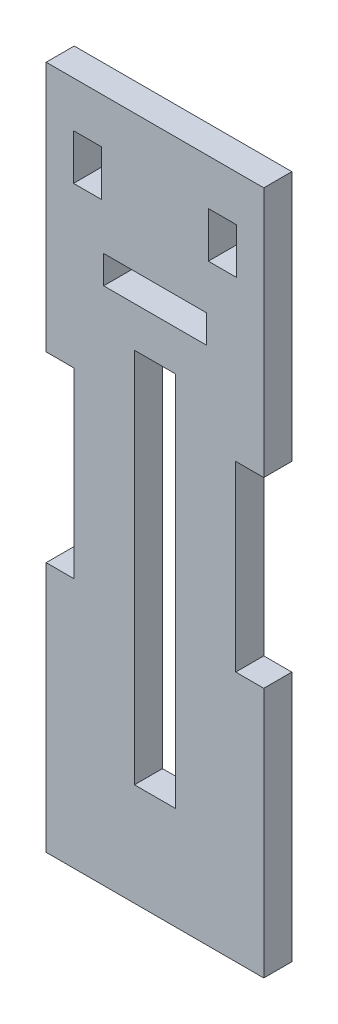
ISO-10303-21;
HEADER;
FILE_DESCRIPTION(('STEP AP214'),'2;1');
FILE_NAME('part.step','',(''),(''),'','','');
FILE_SCHEMA(('AUTOMOTIVE_DESIGN { 1 0 10303 214 1 1 1 1 }'));
ENDSEC;
DATA;
#1=APPLICATION_CONTEXT('core data for automotive mechanical design processes');
#2=APPLICATION_PROTOCOL_DEFINITION('international standard','automotive_design',2000,#1);
#3=PRODUCT_CONTEXT('',#1,'mechanical');
#4=PRODUCT('Part','Part','',(#3));
#5=PRODUCT_RELATED_PRODUCT_CATEGORY('part','',(#4));
#6=PRODUCT_DEFINITION_FORMATION('','',#4);
#7=PRODUCT_DEFINITION_CONTEXT('part definition',#1,'design');
#8=PRODUCT_DEFINITION('design','',#6,#7);
#9=PRODUCT_DEFINITION_SHAPE('','',#8);
#10=(LENGTH_UNIT() NAMED_UNIT(*) SI_UNIT(.MILLI.,.METRE.));
#11=(NAMED_UNIT(*) PLANE_ANGLE_UNIT() SI_UNIT($,.RADIAN.));
#12=(NAMED_UNIT(*) SI_UNIT($,.STERADIAN.) SOLID_ANGLE_UNIT());
#13=UNCERTAINTY_MEASURE_WITH_UNIT(LENGTH_MEASURE(1.E-05),#10,'distance_accuracy_value','');
#14=(GEOMETRIC_REPRESENTATION_CONTEXT(3) GLOBAL_UNCERTAINTY_ASSIGNED_CONTEXT((#13)) GLOBAL_UNIT_ASSIGNED_CONTEXT((#10,
#11,#12)) REPRESENTATION_CONTEXT('',''));
#15=CARTESIAN_POINT('',(0.,0.,0.));
#16=DIRECTION('',(0.,0.,1.));
#17=DIRECTION('',(1.,0.,0.));
#18=AXIS2_PLACEMENT_3D('',#15,#16,#17);
#19=CARTESIAN_POINT('',(0.,0.,0.));
#20=DIRECTION('',(0.,0.,1.));
#21=DIRECTION('',(1.,0.,0.));
#22=AXIS2_PLACEMENT_3D('',#19,#20,#21);
#23=PLANE('',#22);
#24=DIRECTION('',(0.,1.,0.));
#25=VECTOR('',#24,1.);
#26=CARTESIAN_POINT('',(-37.3616468699804,-19.3829047188593,0.));
#27=LINE('',#26,#25);
#28=CARTESIAN_POINT('',(-37.3616468699803,-89.2329047188593,0.));
#29=VERTEX_POINT('',#28);
#30=CARTESIAN_POINT('',(-37.3616468699804,-19.3829047188593,0.));
#31=VERTEX_POINT('',#30);
#32=EDGE_CURVE('E351',#29,#31,#27,.T.);
#33=ORIENTED_EDGE('',*,*,#32,.T.);
#34=DIRECTION('',(-1.,0.,0.));
#35=VECTOR('',#34,1.);
#36=CARTESIAN_POINT('',(-44.9816468699804,-19.3829047188593,0.));
#37=LINE('',#36,#35);
#38=CARTESIAN_POINT('',(-44.9816468699804,-19.3829047188593,0.));
#39=VERTEX_POINT('',#38);
#40=EDGE_CURVE('E365',#31,#39,#37,.T.);
#41=ORIENTED_EDGE('',*,*,#40,.T.);
#42=DIRECTION('',(0.,-1.,0.));
#43=VECTOR('',#42,1.);
#44=CARTESIAN_POINT('',(-44.9816468699804,-19.3829047188593,0.));
#45=LINE('',#44,#43);
#46=CARTESIAN_POINT('',(-44.9816468699803,-89.2329047188593,0.));
#47=VERTEX_POINT('',#46);
#48=EDGE_CURVE('E368',#39,#47,#45,.T.);
#49=ORIENTED_EDGE('',*,*,#48,.T.);
#50=DIRECTION('',(1.,0.,0.));
#51=VECTOR('',#50,1.);
#52=CARTESIAN_POINT('',(-44.9816468699803,-89.2329047188593,0.));
#53=LINE('',#52,#51);
#54=EDGE_CURVE('E355',#47,#29,#53,.T.);
#55=ORIENTED_EDGE('',*,*,#54,.T.);
#56=EDGE_LOOP('',(#33,#41,#49,#55));
#57=FACE_BOUND('',#56,.T.);
#58=DIRECTION('',(-1.,0.,0.));
#59=VECTOR('',#58,1.);
#60=CARTESIAN_POINT('',(-20.9786468699804,18.7170952811407,0.));
#61=LINE('',#60,#59);
#62=CARTESIAN_POINT('',(-20.9786468699804,18.7170952811407,0.));
#63=VERTEX_POINT('',#62);
#64=CARTESIAN_POINT('',(-61.3646468699804,18.7170952811407,0.));
#65=VERTEX_POINT('',#64);
#66=EDGE_CURVE('E398',#63,#65,#61,.T.);
#67=ORIENTED_EDGE('',*,*,#66,.F.);
#68=DIRECTION('',(0.,1.,0.));
#69=VECTOR('',#68,1.);
#70=CARTESIAN_POINT('',(-20.9786468699803,-108.282904718859,0.));
#71=LINE('',#70,#69);
#72=CARTESIAN_POINT('',(-20.9786468699803,-27.8495713855259,0.));
#73=VERTEX_POINT('',#72);
#74=EDGE_CURVE('E382',#73,#63,#71,.T.);
#75=ORIENTED_EDGE('',*,*,#74,.F.);
#76=DIRECTION('',(1.,0.,0.));
#77=VECTOR('',#76,1.);
#78=CARTESIAN_POINT('',(-26.1856468699803,-27.8495713855259,0.));
#79=LINE('',#78,#77);
#80=CARTESIAN_POINT('',(-26.1856468699803,-27.8495713855259,0.));
#81=VERTEX_POINT('',#80);
#82=EDGE_CURVE('E314',#81,#73,#79,.T.);
#83=ORIENTED_EDGE('',*,*,#82,.F.);
#84=DIRECTION('',(0.,1.,0.));
#85=VECTOR('',#84,1.);
#86=CARTESIAN_POINT('',(-26.1856468699803,0.,0.));
#87=LINE('',#86,#85);
#88=CARTESIAN_POINT('',(-26.1856468699803,-61.7162380521926,0.));
#89=VERTEX_POINT('',#88);
#90=EDGE_CURVE('E11',#89,#81,#87,.T.);
#91=ORIENTED_EDGE('',*,*,#90,.F.);
#92=DIRECTION('',(1.,0.,0.));
#93=VECTOR('',#92,1.);
#94=CARTESIAN_POINT('',(-26.1856468699803,-61.7162380521926,0.));
#95=LINE('',#94,#93);
#96=CARTESIAN_POINT('',(-20.9786468699803,-61.7162380521926,0.));
#97=VERTEX_POINT('',#96);
#98=EDGE_CURVE('E325',#89,#97,#95,.T.);
#99=ORIENTED_EDGE('',*,*,#98,.T.);
#100=CARTESIAN_POINT('',(-20.9786468699803,-108.282904718859,0.));
#101=VERTEX_POINT('',#100);
#102=EDGE_CURVE('E396',#101,#97,#71,.T.);
#103=ORIENTED_EDGE('',*,*,#102,.F.);
#104=DIRECTION('',(1.,0.,0.));
#105=VECTOR('',#104,1.);
#106=CARTESIAN_POINT('',(-20.9786468699803,-108.282904718859,0.));
#107=LINE('',#106,#105);
#108=CARTESIAN_POINT('',(-61.3646468699804,-108.282904718859,0.));
#109=VERTEX_POINT('',#108);
#110=EDGE_CURVE('E403',#109,#101,#107,.T.);
#111=ORIENTED_EDGE('',*,*,#110,.F.);
#112=DIRECTION('',(0.,-1.,0.));
#113=VECTOR('',#112,1.);
#114=CARTESIAN_POINT('',(-61.3646468699804,-108.282904718859,0.));
#115=LINE('',#114,#113);
#116=CARTESIAN_POINT('',(-61.3646468699804,-61.7162380521926,0.));
#117=VERTEX_POINT('',#116);
#118=EDGE_CURVE('E400',#117,#109,#115,.T.);
#119=ORIENTED_EDGE('',*,*,#118,.F.);
#120=DIRECTION('',(1.,0.,0.));
#121=VECTOR('',#120,1.);
#122=CARTESIAN_POINT('',(-61.3646468699804,-61.7162380521926,0.));
#123=LINE('',#122,#121);
#124=CARTESIAN_POINT('',(-56.1576468699804,-61.7162380521926,0.));
#125=VERTEX_POINT('',#124);
#126=EDGE_CURVE('E348',#117,#125,#123,.T.);
#127=ORIENTED_EDGE('',*,*,#126,.T.);
#128=DIRECTION('',(0.,1.,0.));
#129=VECTOR('',#128,1.);
#130=CARTESIAN_POINT('',(-56.1576468699803,0.,0.));
#131=LINE('',#130,#129);
#132=CARTESIAN_POINT('',(-56.1576468699804,-27.849571385526,0.));
#133=VERTEX_POINT('',#132);
#134=EDGE_CURVE('E41',#125,#133,#131,.T.);
#135=ORIENTED_EDGE('',*,*,#134,.T.);
#136=DIRECTION('',(1.,0.,0.));
#137=VECTOR('',#136,1.);
#138=CARTESIAN_POINT('',(-61.3646468699804,-27.849571385526,0.));
#139=LINE('',#138,#137);
#140=CARTESIAN_POINT('',(-61.3646468699804,-27.849571385526,0.));
#141=VERTEX_POINT('',#140);
#142=EDGE_CURVE('E335',#141,#133,#139,.T.);
#143=ORIENTED_EDGE('',*,*,#142,.F.);
#144=EDGE_CURVE('E401',#65,#141,#115,.T.);
#145=ORIENTED_EDGE('',*,*,#144,.F.);
#146=EDGE_LOOP('',(#67,#75,#83,#91,#99,#103,#111,#119,#127,#135,#143,#145));
#147=FACE_BOUND('',#146,.T.);
#148=DIRECTION('',(1.,0.,0.));
#149=VECTOR('',#148,1.);
#150=CARTESIAN_POINT('',(-31.2656468699804,10.2504286144741,0.));
#151=LINE('',#150,#149);
#152=CARTESIAN_POINT('',(-31.2656468699804,10.2504286144741,0.));
#153=VERTEX_POINT('',#152);
#154=CARTESIAN_POINT('',(-26.0586468699804,10.2504286144741,0.));
#155=VERTEX_POINT('',#154);
#156=EDGE_CURVE('E294',#153,#155,#151,.T.);
#157=ORIENTED_EDGE('',*,*,#156,.F.);
#158=DIRECTION('',(0.,-1.,0.));
#159=VECTOR('',#158,1.);
#160=CARTESIAN_POINT('',(-31.2656468699804,1.78376194780739,0.));
#161=LINE('',#160,#159);
#162=CARTESIAN_POINT('',(-31.2656468699804,1.78376194780739,0.));
#163=VERTEX_POINT('',#162);
#164=EDGE_CURVE('E276',#153,#163,#161,.T.);
#165=ORIENTED_EDGE('',*,*,#164,.T.);
#166=DIRECTION('',(1.,0.,0.));
#167=VECTOR('',#166,1.);
#168=CARTESIAN_POINT('',(-31.2656468699804,1.78376194780739,0.));
#169=LINE('',#168,#167);
#170=CARTESIAN_POINT('',(-26.0586468699804,1.78376194780739,0.));
#171=VERTEX_POINT('',#170);
#172=EDGE_CURVE('E291',#163,#171,#169,.T.);
#173=ORIENTED_EDGE('',*,*,#172,.T.);
#174=DIRECTION('',(0.,-1.,0.));
#175=VECTOR('',#174,1.);
#176=CARTESIAN_POINT('',(-26.0586468699804,1.78376194780739,0.));
#177=LINE('',#176,#175);
#178=EDGE_CURVE('E286',#155,#171,#177,.T.);
#179=ORIENTED_EDGE('',*,*,#178,.F.);
#180=EDGE_LOOP('',(#157,#165,#173,#179));
#181=FACE_BOUND('',#180,.T.);
#182=DIRECTION('',(-1.,0.,0.));
#183=VECTOR('',#182,1.);
#184=CARTESIAN_POINT('',(-51.0776468699804,1.78376194780742,0.));
#185=LINE('',#184,#183);
#186=CARTESIAN_POINT('',(-51.0776468699804,1.78376194780742,0.));
#187=VERTEX_POINT('',#186);
#188=CARTESIAN_POINT('',(-56.2846468699804,1.78376194780742,0.));
#189=VERTEX_POINT('',#188);
#190=EDGE_CURVE('E263',#187,#189,#185,.T.);
#191=ORIENTED_EDGE('',*,*,#190,.F.);
#192=DIRECTION('',(0.,1.,0.));
#193=VECTOR('',#192,1.);
#194=CARTESIAN_POINT('',(-51.0776468699804,10.2504286144741,0.));
#195=LINE('',#194,#193);
#196=CARTESIAN_POINT('',(-51.0776468699804,10.2504286144741,0.));
#197=VERTEX_POINT('',#196);
#198=EDGE_CURVE('E248',#187,#197,#195,.T.);
#199=ORIENTED_EDGE('',*,*,#198,.T.);
#200=DIRECTION('',(-1.,0.,0.));
#201=VECTOR('',#200,1.);
#202=CARTESIAN_POINT('',(-51.0776468699804,10.2504286144741,0.));
#203=LINE('',#202,#201);
#204=CARTESIAN_POINT('',(-56.2846468699804,10.2504286144741,0.));
#205=VERTEX_POINT('',#204);
#206=EDGE_CURVE('E260',#197,#205,#203,.T.);
#207=ORIENTED_EDGE('',*,*,#206,.T.);
#208=DIRECTION('',(0.,1.,0.));
#209=VECTOR('',#208,1.);
#210=CARTESIAN_POINT('',(-56.2846468699804,10.2504286144741,0.));
#211=LINE('',#210,#209);
#212=EDGE_CURVE('E242',#189,#205,#211,.T.);
#213=ORIENTED_EDGE('',*,*,#212,.F.);
#214=EDGE_LOOP('',(#191,#199,#207,#213));
#215=FACE_BOUND('',#214,.T.);
#216=DIRECTION('',(1.,0.,0.));
#217=VECTOR('',#216,1.);
#218=CARTESIAN_POINT('',(-50.6966468699804,-11.8899047188593,0.));
#219=LINE('',#218,#217);
#220=CARTESIAN_POINT('',(-50.6966468699804,-11.8899047188593,0.));
#221=VERTEX_POINT('',#220);
#222=CARTESIAN_POINT('',(-31.6466468699804,-11.8899047188593,0.));
#223=VERTEX_POINT('',#222);
#224=EDGE_CURVE('E225',#221,#223,#219,.T.);
#225=ORIENTED_EDGE('',*,*,#224,.T.);
#226=DIRECTION('',(0.,1.,0.));
#227=VECTOR('',#226,1.);
#228=CARTESIAN_POINT('',(-31.6466468699804,-11.8899047188593,0.));
#229=LINE('',#228,#227);
#230=CARTESIAN_POINT('',(-31.6466468699804,-6.68290471885927,0.));
#231=VERTEX_POINT('',#230);
#232=EDGE_CURVE('E740',#223,#231,#229,.T.);
#233=ORIENTED_EDGE('',*,*,#232,.T.);
#234=DIRECTION('',(1.,0.,0.));
#235=VECTOR('',#234,1.);
#236=CARTESIAN_POINT('',(-50.6966468699804,-6.68290471885927,0.));
#237=LINE('',#236,#235);
#238=CARTESIAN_POINT('',(-50.6966468699804,-6.68290471885927,0.));
#239=VERTEX_POINT('',#238);
#240=EDGE_CURVE('E746',#239,#231,#237,.T.);
#241=ORIENTED_EDGE('',*,*,#240,.F.);
#242=DIRECTION('',(0.,1.,0.));
#243=VECTOR('',#242,1.);
#244=CARTESIAN_POINT('',(-50.6966468699804,-11.8899047188593,0.));
#245=LINE('',#244,#243);
#246=EDGE_CURVE('E56',#221,#239,#245,.T.);
#247=ORIENTED_EDGE('',*,*,#246,.F.);
#248=EDGE_LOOP('',(#225,#233,#241,#247));
#249=FACE_BOUND('',#248,.T.);
#250=ADVANCED_FACE('F33',(#57,#147,#181,#215,#249),#23,.F.);
#251=CARTESIAN_POINT('',(0.,0.,5.207));
#252=DIRECTION('',(0.,0.,1.));
#253=DIRECTION('',(1.,0.,0.));
#254=AXIS2_PLACEMENT_3D('',#251,#252,#253);
#255=PLANE('',#254);
#256=DIRECTION('',(0.,1.,0.));
#257=VECTOR('',#256,1.);
#258=CARTESIAN_POINT('',(-31.6466468699804,-11.8899047188593,5.207));
#259=LINE('',#258,#257);
#260=CARTESIAN_POINT('',(-31.6466468699804,-11.8899047188593,5.207));
#261=VERTEX_POINT('',#260);
#262=CARTESIAN_POINT('',(-31.6466468699804,-6.68290471885927,5.207));
#263=VERTEX_POINT('',#262);
#264=EDGE_CURVE('E238',#261,#263,#259,.T.);
#265=ORIENTED_EDGE('',*,*,#264,.F.);
#266=DIRECTION('',(-1.,0.,0.));
#267=VECTOR('',#266,1.);
#268=CARTESIAN_POINT('',(0.,-11.8899047188593,5.207));
#269=LINE('',#268,#267);
#270=CARTESIAN_POINT('',(-50.6966468699804,-11.8899047188593,5.207));
#271=VERTEX_POINT('',#270);
#272=EDGE_CURVE('E222',#261,#271,#269,.T.);
#273=ORIENTED_EDGE('',*,*,#272,.T.);
#274=DIRECTION('',(0.,1.,0.));
#275=VECTOR('',#274,1.);
#276=CARTESIAN_POINT('',(-50.6966468699804,-11.8899047188593,5.207));
#277=LINE('',#276,#275);
#278=CARTESIAN_POINT('',(-50.6966468699804,-6.68290471885927,5.207));
#279=VERTEX_POINT('',#278);
#280=EDGE_CURVE('E228',#271,#279,#277,.T.);
#281=ORIENTED_EDGE('',*,*,#280,.T.);
#282=DIRECTION('',(-1.,0.,0.));
#283=VECTOR('',#282,1.);
#284=CARTESIAN_POINT('',(0.,-6.68290471885927,5.207));
#285=LINE('',#284,#283);
#286=EDGE_CURVE('E233',#263,#279,#285,.T.);
#287=ORIENTED_EDGE('',*,*,#286,.F.);
#288=EDGE_LOOP('',(#265,#273,#281,#287));
#289=FACE_BOUND('',#288,.T.);
#290=DIRECTION('',(-1.,0.,0.));
#291=VECTOR('',#290,1.);
#292=CARTESIAN_POINT('',(-44.9816468699804,-19.3829047188593,5.207));
#293=LINE('',#292,#291);
#294=CARTESIAN_POINT('',(-37.3616468699804,-19.3829047188593,5.207));
#295=VERTEX_POINT('',#294);
#296=CARTESIAN_POINT('',(-44.9816468699804,-19.3829047188593,5.207));
#297=VERTEX_POINT('',#296);
#298=EDGE_CURVE('E354',#295,#297,#293,.T.);
#299=ORIENTED_EDGE('',*,*,#298,.F.);
#300=DIRECTION('',(0.,1.,0.));
#301=VECTOR('',#300,1.);
#302=CARTESIAN_POINT('',(-37.3616468699804,-19.3829047188593,5.207));
#303=LINE('',#302,#301);
#304=CARTESIAN_POINT('',(-37.3616468699803,-89.2329047188593,5.207));
#305=VERTEX_POINT('',#304);
#306=EDGE_CURVE('E352',#305,#295,#303,.T.);
#307=ORIENTED_EDGE('',*,*,#306,.F.);
#308=DIRECTION('',(1.,0.,0.));
#309=VECTOR('',#308,1.);
#310=CARTESIAN_POINT('',(-44.9816468699803,-89.2329047188593,5.207));
#311=LINE('',#310,#309);
#312=CARTESIAN_POINT('',(-44.9816468699803,-89.2329047188593,5.207));
#313=VERTEX_POINT('',#312);
#314=EDGE_CURVE('E360',#313,#305,#311,.T.);
#315=ORIENTED_EDGE('',*,*,#314,.F.);
#316=DIRECTION('',(0.,-1.,0.));
#317=VECTOR('',#316,1.);
#318=CARTESIAN_POINT('',(-44.9816468699804,-19.3829047188593,5.207));
#319=LINE('',#318,#317);
#320=EDGE_CURVE('E357',#297,#313,#319,.T.);
#321=ORIENTED_EDGE('',*,*,#320,.F.);
#322=EDGE_LOOP('',(#299,#307,#315,#321));
#323=FACE_BOUND('',#322,.T.);
#324=DIRECTION('',(0.,-1.,0.));
#325=VECTOR('',#324,1.);
#326=CARTESIAN_POINT('',(-31.2656468699804,0.,5.207));
#327=LINE('',#326,#325);
#328=CARTESIAN_POINT('',(-31.2656468699804,10.2504286144741,5.207));
#329=VERTEX_POINT('',#328);
#330=CARTESIAN_POINT('',(-31.2656468699804,1.78376194780739,5.207));
#331=VERTEX_POINT('',#330);
#332=EDGE_CURVE('E302',#329,#331,#327,.T.);
#333=ORIENTED_EDGE('',*,*,#332,.F.);
#334=DIRECTION('',(1.,0.,0.));
#335=VECTOR('',#334,1.);
#336=CARTESIAN_POINT('',(-31.2656468699804,10.2504286144741,5.207));
#337=LINE('',#336,#335);
#338=CARTESIAN_POINT('',(-26.0586468699804,10.2504286144741,5.207));
#339=VERTEX_POINT('',#338);
#340=EDGE_CURVE('E296',#329,#339,#337,.T.);
#341=ORIENTED_EDGE('',*,*,#340,.T.);
#342=DIRECTION('',(0.,-1.,0.));
#343=VECTOR('',#342,1.);
#344=CARTESIAN_POINT('',(-26.0586468699804,0.,5.207));
#345=LINE('',#344,#343);
#346=CARTESIAN_POINT('',(-26.0586468699804,1.78376194780739,5.207));
#347=VERTEX_POINT('',#346);
#348=EDGE_CURVE('E299',#339,#347,#345,.T.);
#349=ORIENTED_EDGE('',*,*,#348,.T.);
#350=DIRECTION('',(1.,0.,0.));
#351=VECTOR('',#350,1.);
#352=CARTESIAN_POINT('',(-31.2656468699804,1.78376194780739,5.207));
#353=LINE('',#352,#351);
#354=EDGE_CURVE('E283',#331,#347,#353,.T.);
#355=ORIENTED_EDGE('',*,*,#354,.F.);
#356=EDGE_LOOP('',(#333,#341,#349,#355));
#357=FACE_BOUND('',#356,.T.);
#358=DIRECTION('',(-1.,0.,0.));
#359=VECTOR('',#358,1.);
#360=CARTESIAN_POINT('',(-20.9786468699804,18.7170952811407,5.207));
#361=LINE('',#360,#359);
#362=CARTESIAN_POINT('',(-20.9786468699804,18.7170952811407,5.207));
#363=VERTEX_POINT('',#362);
#364=CARTESIAN_POINT('',(-61.3646468699804,18.7170952811407,5.207));
#365=VERTEX_POINT('',#364);
#366=EDGE_CURVE('E386',#363,#365,#361,.T.);
#367=ORIENTED_EDGE('',*,*,#366,.T.);
#368=DIRECTION('',(0.,-1.,0.));
#369=VECTOR('',#368,1.);
#370=CARTESIAN_POINT('',(-61.3646468699804,-108.282904718859,5.207));
#371=LINE('',#370,#369);
#372=CARTESIAN_POINT('',(-61.3646468699804,-27.849571385526,5.207));
#373=VERTEX_POINT('',#372);
#374=EDGE_CURVE('E390',#365,#373,#371,.T.);
#375=ORIENTED_EDGE('',*,*,#374,.T.);
#376=DIRECTION('',(1.,0.,0.));
#377=VECTOR('',#376,1.);
#378=CARTESIAN_POINT('',(-61.3646468699804,-27.849571385526,5.20699999999997));
#379=LINE('',#378,#377);
#380=CARTESIAN_POINT('',(-56.1576468699804,-27.849571385526,5.20699999999997));
#381=VERTEX_POINT('',#380);
#382=EDGE_CURVE('E342',#373,#381,#379,.T.);
#383=ORIENTED_EDGE('',*,*,#382,.T.);
#384=DIRECTION('',(0.,1.,0.));
#385=VECTOR('',#384,1.);
#386=CARTESIAN_POINT('',(-56.1576468699804,-61.7162380521926,5.20699999999997));
#387=LINE('',#386,#385);
#388=CARTESIAN_POINT('',(-56.1576468699804,-61.7162380521926,5.20699999999997));
#389=VERTEX_POINT('',#388);
#390=EDGE_CURVE('E337',#389,#381,#387,.T.);
#391=ORIENTED_EDGE('',*,*,#390,.F.);
#392=DIRECTION('',(1.,0.,0.));
#393=VECTOR('',#392,1.);
#394=CARTESIAN_POINT('',(-61.3646468699804,-61.7162380521926,5.20699999999997));
#395=LINE('',#394,#393);
#396=CARTESIAN_POINT('',(-61.3646468699804,-61.7162380521926,5.20699999999997));
#397=VERTEX_POINT('',#396);
#398=EDGE_CURVE('E345',#397,#389,#395,.T.);
#399=ORIENTED_EDGE('',*,*,#398,.F.);
#400=CARTESIAN_POINT('',(-61.3646468699804,-108.282904718859,5.207));
#401=VERTEX_POINT('',#400);
#402=EDGE_CURVE('E389',#397,#401,#371,.T.);
#403=ORIENTED_EDGE('',*,*,#402,.T.);
#404=DIRECTION('',(1.,0.,0.));
#405=VECTOR('',#404,1.);
#406=CARTESIAN_POINT('',(-20.9786468699803,-108.282904718859,5.207));
#407=LINE('',#406,#405);
#408=CARTESIAN_POINT('',(-20.9786468699803,-108.282904718859,5.207));
#409=VERTEX_POINT('',#408);
#410=EDGE_CURVE('E393',#401,#409,#407,.T.);
#411=ORIENTED_EDGE('',*,*,#410,.T.);
#412=DIRECTION('',(0.,1.,0.));
#413=VECTOR('',#412,1.);
#414=CARTESIAN_POINT('',(-20.9786468699803,-108.282904718859,5.207));
#415=LINE('',#414,#413);
#416=CARTESIAN_POINT('',(-20.9786468699803,-61.7162380521926,5.20699999999997));
#417=VERTEX_POINT('',#416);
#418=EDGE_CURVE('E383',#409,#417,#415,.T.);
#419=ORIENTED_EDGE('',*,*,#418,.T.);
#420=DIRECTION('',(1.,0.,0.));
#421=VECTOR('',#420,1.);
#422=CARTESIAN_POINT('',(-26.1856468699803,-61.7162380521926,5.20699999999997));
#423=LINE('',#422,#421);
#424=CARTESIAN_POINT('',(-26.1856468699803,-61.7162380521926,5.20699999999997));
#425=VERTEX_POINT('',#424);
#426=EDGE_CURVE('E323',#425,#417,#423,.T.);
#427=ORIENTED_EDGE('',*,*,#426,.F.);
#428=DIRECTION('',(0.,1.,0.));
#429=VECTOR('',#428,1.);
#430=CARTESIAN_POINT('',(-26.1856468699803,-61.7162380521926,5.20699999999997));
#431=LINE('',#430,#429);
#432=CARTESIAN_POINT('',(-26.1856468699803,-27.8495713855259,5.20699999999996));
#433=VERTEX_POINT('',#432);
#434=EDGE_CURVE('E307',#425,#433,#431,.T.);
#435=ORIENTED_EDGE('',*,*,#434,.T.);
#436=DIRECTION('',(1.,0.,0.));
#437=VECTOR('',#436,1.);
#438=CARTESIAN_POINT('',(-26.1856468699803,-27.8495713855259,5.20699999999996));
#439=LINE('',#438,#437);
#440=CARTESIAN_POINT('',(-20.9786468699803,-27.8495713855259,5.20699999999996));
#441=VERTEX_POINT('',#440);
#442=EDGE_CURVE('E320',#433,#441,#439,.T.);
#443=ORIENTED_EDGE('',*,*,#442,.T.);
#444=EDGE_CURVE('E387',#441,#363,#415,.T.);
#445=ORIENTED_EDGE('',*,*,#444,.T.);
#446=EDGE_LOOP('',(#367,#375,#383,#391,#399,#403,#411,#419,#427,#435,#443,#445));
#447=FACE_BOUND('',#446,.T.);
#448=DIRECTION('',(0.,1.,0.));
#449=VECTOR('',#448,1.);
#450=CARTESIAN_POINT('',(-51.0776468699804,0.,5.207));
#451=LINE('',#450,#449);
#452=CARTESIAN_POINT('',(-51.0776468699804,1.78376194780742,5.20699999999998));
#453=VERTEX_POINT('',#452);
#454=CARTESIAN_POINT('',(-51.0776468699804,10.2504286144741,5.20699999999998));
#455=VERTEX_POINT('',#454);
#456=EDGE_CURVE('E271',#453,#455,#451,.T.);
#457=ORIENTED_EDGE('',*,*,#456,.F.);
#458=DIRECTION('',(-1.,0.,0.));
#459=VECTOR('',#458,1.);
#460=CARTESIAN_POINT('',(-51.0776468699804,1.78376194780742,5.20699999999998));
#461=LINE('',#460,#459);
#462=CARTESIAN_POINT('',(-56.2846468699804,1.78376194780742,5.20699999999998));
#463=VERTEX_POINT('',#462);
#464=EDGE_CURVE('E265',#453,#463,#461,.T.);
#465=ORIENTED_EDGE('',*,*,#464,.T.);
#466=DIRECTION('',(0.,1.,0.));
#467=VECTOR('',#466,1.);
#468=CARTESIAN_POINT('',(-56.2846468699804,0.,5.207));
#469=LINE('',#468,#467);
#470=CARTESIAN_POINT('',(-56.2846468699804,10.2504286144741,5.207));
#471=VERTEX_POINT('',#470);
#472=EDGE_CURVE('E268',#463,#471,#469,.T.);
#473=ORIENTED_EDGE('',*,*,#472,.T.);
#474=DIRECTION('',(-1.,0.,0.));
#475=VECTOR('',#474,1.);
#476=CARTESIAN_POINT('',(-51.0776468699804,10.2504286144741,5.20699999999998));
#477=LINE('',#476,#475);
#478=EDGE_CURVE('E254',#455,#471,#477,.T.);
#479=ORIENTED_EDGE('',*,*,#478,.F.);
#480=EDGE_LOOP('',(#457,#465,#473,#479));
#481=FACE_BOUND('',#480,.T.);
#482=ADVANCED_FACE('F236',(#289,#323,#357,#447,#481),#255,.T.);
#483=CARTESIAN_POINT('',(-20.9786468699803,-108.282904718859,5.207));
#484=DIRECTION('',(-1.,0.,0.));
#485=DIRECTION('',(0.,-1.,0.));
#486=AXIS2_PLACEMENT_3D('',#483,#484,#485);
#487=PLANE('',#486);
#488=DIRECTION('',(0.,0.,1.));
#489=VECTOR('',#488,1.);
#490=CARTESIAN_POINT('',(-20.9786468699803,-61.7162380521926,0.));
#491=LINE('',#490,#489);
#492=EDGE_CURVE('E304',#97,#417,#491,.T.);
#493=ORIENTED_EDGE('',*,*,#492,.T.);
#494=ORIENTED_EDGE('',*,*,#418,.F.);
#495=DIRECTION('',(0.,0.,-1.));
#496=VECTOR('',#495,1.);
#497=CARTESIAN_POINT('',(-20.9786468699803,-108.282904718859,5.207));
#498=LINE('',#497,#496);
#499=EDGE_CURVE('E395',#409,#101,#498,.T.);
#500=ORIENTED_EDGE('',*,*,#499,.T.);
#501=ORIENTED_EDGE('',*,*,#102,.T.);
#502=EDGE_LOOP('',(#493,#494,#500,#501));
#503=FACE_BOUND('',#502,.T.);
#504=ADVANCED_FACE('F35',(#503),#487,.F.);
#505=DIRECTION('',(0.,0.,-1.));
#506=VECTOR('',#505,1.);
#507=CARTESIAN_POINT('',(-20.9786468699803,-27.8495713855259,0.));
#508=LINE('',#507,#506);
#509=EDGE_CURVE('E308',#441,#73,#508,.T.);
#510=ORIENTED_EDGE('',*,*,#509,.T.);
#511=ORIENTED_EDGE('',*,*,#74,.T.);
#512=DIRECTION('',(0.,0.,-1.));
#513=VECTOR('',#512,1.);
#514=CARTESIAN_POINT('',(-20.9786468699804,18.7170952811407,5.207));
#515=LINE('',#514,#513);
#516=EDGE_CURVE('E413',#363,#63,#515,.T.);
#517=ORIENTED_EDGE('',*,*,#516,.F.);
#518=ORIENTED_EDGE('',*,*,#444,.F.);
#519=EDGE_LOOP('',(#510,#511,#517,#518));
#520=FACE_BOUND('',#519,.T.);
#521=ADVANCED_FACE('F449',(#520),#487,.F.);
#522=CARTESIAN_POINT('',(-61.3646468699804,-108.282904718859,5.207));
#523=DIRECTION('',(1.,0.,0.));
#524=DIRECTION('',(0.,0.,-1.));
#525=AXIS2_PLACEMENT_3D('',#522,#523,#524);
#526=PLANE('',#525);
#527=DIRECTION('',(0.,0.,1.));
#528=VECTOR('',#527,1.);
#529=CARTESIAN_POINT('',(-61.3646468699804,-61.7162380521926,0.));
#530=LINE('',#529,#528);
#531=EDGE_CURVE('E329',#117,#397,#530,.T.);
#532=ORIENTED_EDGE('',*,*,#531,.F.);
#533=ORIENTED_EDGE('',*,*,#118,.T.);
#534=DIRECTION('',(0.,0.,-1.));
#535=VECTOR('',#534,1.);
#536=CARTESIAN_POINT('',(-61.3646468699804,-108.282904718859,5.207));
#537=LINE('',#536,#535);
#538=EDGE_CURVE('E407',#401,#109,#537,.T.);
#539=ORIENTED_EDGE('',*,*,#538,.F.);
#540=ORIENTED_EDGE('',*,*,#402,.F.);
#541=EDGE_LOOP('',(#532,#533,#539,#540));
#542=FACE_BOUND('',#541,.T.);
#543=ADVANCED_FACE('F472',(#542),#526,.F.);
#544=DIRECTION('',(0.,0.,-1.));
#545=VECTOR('',#544,1.);
#546=CARTESIAN_POINT('',(-61.3646468699804,-27.849571385526,0.));
#547=LINE('',#546,#545);
#548=EDGE_CURVE('E331',#373,#141,#547,.T.);
#549=ORIENTED_EDGE('',*,*,#548,.F.);
#550=ORIENTED_EDGE('',*,*,#374,.F.);
#551=DIRECTION('',(0.,0.,-1.));
#552=VECTOR('',#551,1.);
#553=CARTESIAN_POINT('',(-61.3646468699804,18.7170952811407,5.207));
#554=LINE('',#553,#552);
#555=EDGE_CURVE('E410',#365,#65,#554,.T.);
#556=ORIENTED_EDGE('',*,*,#555,.T.);
#557=ORIENTED_EDGE('',*,*,#144,.T.);
#558=EDGE_LOOP('',(#549,#550,#556,#557));
#559=FACE_BOUND('',#558,.T.);
#560=ADVANCED_FACE('F439',(#559),#526,.F.);
#561=CARTESIAN_POINT('',(-20.9786468699804,18.7170952811407,5.207));
#562=DIRECTION('',(0.,-1.,0.));
#563=DIRECTION('',(1.,0.,0.));
#564=AXIS2_PLACEMENT_3D('',#561,#562,#563);
#565=PLANE('',#564);
#566=ORIENTED_EDGE('',*,*,#66,.T.);
#567=ORIENTED_EDGE('',*,*,#555,.F.);
#568=ORIENTED_EDGE('',*,*,#366,.F.);
#569=ORIENTED_EDGE('',*,*,#516,.T.);
#570=EDGE_LOOP('',(#566,#567,#568,#569));
#571=FACE_BOUND('',#570,.T.);
#572=ADVANCED_FACE('F445',(#571),#565,.F.);
#573=CARTESIAN_POINT('',(-20.9786468699803,-108.282904718859,5.207));
#574=DIRECTION('',(0.,1.,0.));
#575=DIRECTION('',(0.,0.,1.));
#576=AXIS2_PLACEMENT_3D('',#573,#574,#575);
#577=PLANE('',#576);
#578=ORIENTED_EDGE('',*,*,#110,.T.);
#579=ORIENTED_EDGE('',*,*,#499,.F.);
#580=ORIENTED_EDGE('',*,*,#410,.F.);
#581=ORIENTED_EDGE('',*,*,#538,.T.);
#582=EDGE_LOOP('',(#578,#579,#580,#581));
#583=FACE_BOUND('',#582,.T.);
#584=ADVANCED_FACE('F470',(#583),#577,.F.);
#585=CARTESIAN_POINT('',(-37.3616468699804,-19.3829047188593,5.207));
#586=DIRECTION('',(-1.,0.,0.));
#587=DIRECTION('',(0.,-1.,0.));
#588=AXIS2_PLACEMENT_3D('',#585,#586,#587);
#589=PLANE('',#588);
#590=ORIENTED_EDGE('',*,*,#32,.F.);
#591=DIRECTION('',(0.,0.,-1.));
#592=VECTOR('',#591,1.);
#593=CARTESIAN_POINT('',(-37.3616468699803,-89.2329047188593,5.207));
#594=LINE('',#593,#592);
#595=EDGE_CURVE('E362',#305,#29,#594,.T.);
#596=ORIENTED_EDGE('',*,*,#595,.F.);
#597=ORIENTED_EDGE('',*,*,#306,.T.);
#598=DIRECTION('',(0.,0.,-1.));
#599=VECTOR('',#598,1.);
#600=CARTESIAN_POINT('',(-37.3616468699804,-19.3829047188593,5.207));
#601=LINE('',#600,#599);
#602=EDGE_CURVE('E379',#295,#31,#601,.T.);
#603=ORIENTED_EDGE('',*,*,#602,.T.);
#604=EDGE_LOOP('',(#590,#596,#597,#603));
#605=FACE_BOUND('',#604,.T.);
#606=ADVANCED_FACE('F490',(#605),#589,.T.);
#607=CARTESIAN_POINT('',(-44.9816468699804,-19.3829047188593,5.207));
#608=DIRECTION('',(0.,-1.,0.));
#609=DIRECTION('',(0.,0.,-1.));
#610=AXIS2_PLACEMENT_3D('',#607,#608,#609);
#611=PLANE('',#610);
#612=ORIENTED_EDGE('',*,*,#40,.F.);
#613=ORIENTED_EDGE('',*,*,#602,.F.);
#614=ORIENTED_EDGE('',*,*,#298,.T.);
#615=DIRECTION('',(0.,0.,-1.));
#616=VECTOR('',#615,1.);
#617=CARTESIAN_POINT('',(-44.9816468699804,-19.3829047188593,5.207));
#618=LINE('',#617,#616);
#619=EDGE_CURVE('E377',#297,#39,#618,.T.);
#620=ORIENTED_EDGE('',*,*,#619,.T.);
#621=EDGE_LOOP('',(#612,#613,#614,#620));
#622=FACE_BOUND('',#621,.T.);
#623=ADVANCED_FACE('F495',(#622),#611,.T.);
#624=CARTESIAN_POINT('',(-44.9816468699804,-19.3829047188593,5.207));
#625=DIRECTION('',(1.,0.,0.));
#626=DIRECTION('',(0.,1.,0.));
#627=AXIS2_PLACEMENT_3D('',#624,#625,#626);
#628=PLANE('',#627);
#629=ORIENTED_EDGE('',*,*,#48,.F.);
#630=ORIENTED_EDGE('',*,*,#619,.F.);
#631=ORIENTED_EDGE('',*,*,#320,.T.);
#632=DIRECTION('',(0.,0.,-1.));
#633=VECTOR('',#632,1.);
#634=CARTESIAN_POINT('',(-44.9816468699803,-89.2329047188593,5.207));
#635=LINE('',#634,#633);
#636=EDGE_CURVE('E375',#313,#47,#635,.T.);
#637=ORIENTED_EDGE('',*,*,#636,.T.);
#638=EDGE_LOOP('',(#629,#630,#631,#637));
#639=FACE_BOUND('',#638,.T.);
#640=ADVANCED_FACE('F679',(#639),#628,.T.);
#641=CARTESIAN_POINT('',(-44.9816468699803,-89.2329047188593,5.207));
#642=DIRECTION('',(0.,1.,0.));
#643=DIRECTION('',(0.,0.,1.));
#644=AXIS2_PLACEMENT_3D('',#641,#642,#643);
#645=PLANE('',#644);
#646=ORIENTED_EDGE('',*,*,#54,.F.);
#647=ORIENTED_EDGE('',*,*,#636,.F.);
#648=ORIENTED_EDGE('',*,*,#314,.T.);
#649=ORIENTED_EDGE('',*,*,#595,.T.);
#650=EDGE_LOOP('',(#646,#647,#648,#649));
#651=FACE_BOUND('',#650,.T.);
#652=ADVANCED_FACE('F517',(#651),#645,.T.);
#653=CARTESIAN_POINT('',(-56.1576468699804,-95.5829047188593,0.));
#654=DIRECTION('',(1.,0.,0.));
#655=DIRECTION('',(0.,-1.,0.));
#656=AXIS2_PLACEMENT_3D('',#653,#654,#655);
#657=PLANE('',#656);
#658=DIRECTION('',(0.,0.,1.));
#659=VECTOR('',#658,1.);
#660=CARTESIAN_POINT('',(-56.1576468699804,-61.7162380521926,0.));
#661=LINE('',#660,#659);
#662=EDGE_CURVE('E328',#125,#389,#661,.T.);
#663=ORIENTED_EDGE('',*,*,#662,.T.);
#664=ORIENTED_EDGE('',*,*,#390,.T.);
#665=DIRECTION('',(0.,0.,-1.));
#666=VECTOR('',#665,1.);
#667=CARTESIAN_POINT('',(-56.1576468699804,-27.849571385526,0.));
#668=LINE('',#667,#666);
#669=EDGE_CURVE('E332',#381,#133,#668,.T.);
#670=ORIENTED_EDGE('',*,*,#669,.T.);
#671=ORIENTED_EDGE('',*,*,#134,.F.);
#672=EDGE_LOOP('',(#663,#664,#670,#671));
#673=FACE_BOUND('',#672,.T.);
#674=ADVANCED_FACE('F424',(#673),#657,.F.);
#675=CARTESIAN_POINT('',(-61.3646468699804,-61.7162380521926,0.));
#676=DIRECTION('',(0.,1.,0.));
#677=DIRECTION('',(0.,0.,-1.));
#678=AXIS2_PLACEMENT_3D('',#675,#676,#677);
#679=PLANE('',#678);
#680=ORIENTED_EDGE('',*,*,#662,.F.);
#681=ORIENTED_EDGE('',*,*,#126,.F.);
#682=ORIENTED_EDGE('',*,*,#531,.T.);
#683=ORIENTED_EDGE('',*,*,#398,.T.);
#684=EDGE_LOOP('',(#680,#681,#682,#683));
#685=FACE_BOUND('',#684,.T.);
#686=ADVANCED_FACE('F427',(#685),#679,.T.);
#687=CARTESIAN_POINT('',(-61.3646468699804,-27.849571385526,0.));
#688=DIRECTION('',(0.,-1.,0.));
#689=DIRECTION('',(-1.,0.,0.));
#690=AXIS2_PLACEMENT_3D('',#687,#688,#689);
#691=PLANE('',#690);
#692=ORIENTED_EDGE('',*,*,#669,.F.);
#693=ORIENTED_EDGE('',*,*,#382,.F.);
#694=ORIENTED_EDGE('',*,*,#548,.T.);
#695=ORIENTED_EDGE('',*,*,#142,.T.);
#696=EDGE_LOOP('',(#692,#693,#694,#695));
#697=FACE_BOUND('',#696,.T.);
#698=ADVANCED_FACE('F435',(#697),#691,.T.);
#699=CARTESIAN_POINT('',(-26.1856468699803,-95.5829047188593,0.));
#700=DIRECTION('',(1.,0.,0.));
#701=DIRECTION('',(0.,-1.,0.));
#702=AXIS2_PLACEMENT_3D('',#699,#700,#701);
#703=PLANE('',#702);
#704=ORIENTED_EDGE('',*,*,#90,.T.);
#705=DIRECTION('',(0.,0.,-1.));
#706=VECTOR('',#705,1.);
#707=CARTESIAN_POINT('',(-26.1856468699803,-27.8495713855259,0.));
#708=LINE('',#707,#706);
#709=EDGE_CURVE('E311',#433,#81,#708,.T.);
#710=ORIENTED_EDGE('',*,*,#709,.F.);
#711=ORIENTED_EDGE('',*,*,#434,.F.);
#712=DIRECTION('',(0.,0.,1.));
#713=VECTOR('',#712,1.);
#714=CARTESIAN_POINT('',(-26.1856468699803,-61.7162380521926,0.));
#715=LINE('',#714,#713);
#716=EDGE_CURVE('E305',#89,#425,#715,.T.);
#717=ORIENTED_EDGE('',*,*,#716,.F.);
#718=EDGE_LOOP('',(#704,#710,#711,#717));
#719=FACE_BOUND('',#718,.T.);
#720=ADVANCED_FACE('F457',(#719),#703,.T.);
#721=CARTESIAN_POINT('',(-26.1856468699803,-61.7162380521926,0.));
#722=DIRECTION('',(0.,1.,0.));
#723=DIRECTION('',(0.,0.,-1.));
#724=AXIS2_PLACEMENT_3D('',#721,#722,#723);
#725=PLANE('',#724);
#726=ORIENTED_EDGE('',*,*,#492,.F.);
#727=ORIENTED_EDGE('',*,*,#98,.F.);
#728=ORIENTED_EDGE('',*,*,#716,.T.);
#729=ORIENTED_EDGE('',*,*,#426,.T.);
#730=EDGE_LOOP('',(#726,#727,#728,#729));
#731=FACE_BOUND('',#730,.T.);
#732=ADVANCED_FACE('F463',(#731),#725,.T.);
#733=CARTESIAN_POINT('',(-26.1856468699803,-27.8495713855259,0.));
#734=DIRECTION('',(0.,-1.,0.));
#735=DIRECTION('',(-1.,0.,0.));
#736=AXIS2_PLACEMENT_3D('',#733,#734,#735);
#737=PLANE('',#736);
#738=ORIENTED_EDGE('',*,*,#509,.F.);
#739=ORIENTED_EDGE('',*,*,#442,.F.);
#740=ORIENTED_EDGE('',*,*,#709,.T.);
#741=ORIENTED_EDGE('',*,*,#82,.T.);
#742=EDGE_LOOP('',(#738,#739,#740,#741));
#743=FACE_BOUND('',#742,.T.);
#744=ADVANCED_FACE('F451',(#743),#737,.T.);
#745=CARTESIAN_POINT('',(-31.2656468699804,10.2504286144741,5.207));
#746=DIRECTION('',(0.,-1.,0.));
#747=DIRECTION('',(-1.,0.,0.));
#748=AXIS2_PLACEMENT_3D('',#745,#746,#747);
#749=PLANE('',#748);
#750=DIRECTION('',(0.,0.,-1.));
#751=VECTOR('',#750,1.);
#752=CARTESIAN_POINT('',(-26.0586468699804,10.2504286144741,5.207));
#753=LINE('',#752,#751);
#754=EDGE_CURVE('E273',#339,#155,#753,.T.);
#755=ORIENTED_EDGE('',*,*,#754,.F.);
#756=ORIENTED_EDGE('',*,*,#340,.F.);
#757=DIRECTION('',(0.,0.,-1.));
#758=VECTOR('',#757,1.);
#759=CARTESIAN_POINT('',(-31.2656468699804,10.2504286144741,5.207));
#760=LINE('',#759,#758);
#761=EDGE_CURVE('E274',#329,#153,#760,.T.);
#762=ORIENTED_EDGE('',*,*,#761,.T.);
#763=ORIENTED_EDGE('',*,*,#156,.T.);
#764=EDGE_LOOP('',(#755,#756,#762,#763));
#765=FACE_BOUND('',#764,.T.);
#766=ADVANCED_FACE('F552',(#765),#749,.T.);
#767=CARTESIAN_POINT('',(-31.2656468699804,1.78376194780739,5.207));
#768=DIRECTION('',(0.,1.,0.));
#769=DIRECTION('',(1.,0.,0.));
#770=AXIS2_PLACEMENT_3D('',#767,#768,#769);
#771=PLANE('',#770);
#772=DIRECTION('',(0.,0.,1.));
#773=VECTOR('',#772,1.);
#774=CARTESIAN_POINT('',(-26.0586468699804,1.78376194780739,5.207));
#775=LINE('',#774,#773);
#776=EDGE_CURVE('E277',#171,#347,#775,.T.);
#777=ORIENTED_EDGE('',*,*,#776,.F.);
#778=ORIENTED_EDGE('',*,*,#172,.F.);
#779=DIRECTION('',(0.,0.,1.));
#780=VECTOR('',#779,1.);
#781=CARTESIAN_POINT('',(-31.2656468699804,1.78376194780739,5.207));
#782=LINE('',#781,#780);
#783=EDGE_CURVE('E280',#163,#331,#782,.T.);
#784=ORIENTED_EDGE('',*,*,#783,.T.);
#785=ORIENTED_EDGE('',*,*,#354,.T.);
#786=EDGE_LOOP('',(#777,#778,#784,#785));
#787=FACE_BOUND('',#786,.T.);
#788=ADVANCED_FACE('F563',(#787),#771,.T.);
#789=CARTESIAN_POINT('',(-31.2656468699804,10.8224622338565,24.4598150597806));
#790=DIRECTION('',(-1.,0.,0.));
#791=DIRECTION('',(0.,0.,-1.));
#792=AXIS2_PLACEMENT_3D('',#789,#790,#791);
#793=PLANE('',#792);
#794=ORIENTED_EDGE('',*,*,#332,.T.);
#795=ORIENTED_EDGE('',*,*,#783,.F.);
#796=ORIENTED_EDGE('',*,*,#164,.F.);
#797=ORIENTED_EDGE('',*,*,#761,.F.);
#798=EDGE_LOOP('',(#794,#795,#796,#797));
#799=FACE_BOUND('',#798,.T.);
#800=ADVANCED_FACE('F573',(#799),#793,.F.);
#801=CARTESIAN_POINT('',(-26.0586468699804,10.8224622338565,24.4598150597806));
#802=DIRECTION('',(-1.,0.,0.));
#803=DIRECTION('',(0.,0.,-1.));
#804=AXIS2_PLACEMENT_3D('',#801,#802,#803);
#805=PLANE('',#804);
#806=ORIENTED_EDGE('',*,*,#754,.T.);
#807=ORIENTED_EDGE('',*,*,#178,.T.);
#808=ORIENTED_EDGE('',*,*,#776,.T.);
#809=ORIENTED_EDGE('',*,*,#348,.F.);
#810=EDGE_LOOP('',(#806,#807,#808,#809));
#811=FACE_BOUND('',#810,.T.);
#812=ADVANCED_FACE('F583',(#811),#805,.T.);
#813=CARTESIAN_POINT('',(-51.0776468699804,1.78376194780742,5.20699999999998));
#814=DIRECTION('',(0.,1.,0.));
#815=DIRECTION('',(1.,0.,0.));
#816=AXIS2_PLACEMENT_3D('',#813,#814,#815);
#817=PLANE('',#816);
#818=DIRECTION('',(0.,0.,-1.));
#819=VECTOR('',#818,1.);
#820=CARTESIAN_POINT('',(-56.2846468699804,1.78376194780742,5.20699999999998));
#821=LINE('',#820,#819);
#822=EDGE_CURVE('E239',#463,#189,#821,.T.);
#823=ORIENTED_EDGE('',*,*,#822,.F.);
#824=ORIENTED_EDGE('',*,*,#464,.F.);
#825=DIRECTION('',(0.,0.,-1.));
#826=VECTOR('',#825,1.);
#827=CARTESIAN_POINT('',(-51.0776468699804,1.78376194780742,5.20699999999998));
#828=LINE('',#827,#826);
#829=EDGE_CURVE('E246',#453,#187,#828,.T.);
#830=ORIENTED_EDGE('',*,*,#829,.T.);
#831=ORIENTED_EDGE('',*,*,#190,.T.);
#832=EDGE_LOOP('',(#823,#824,#830,#831));
#833=FACE_BOUND('',#832,.T.);
#834=ADVANCED_FACE('F593',(#833),#817,.T.);
#835=CARTESIAN_POINT('',(-51.0776468699804,10.2504286144741,5.20699999999998));
#836=DIRECTION('',(0.,-1.,0.));
#837=DIRECTION('',(-1.,0.,0.));
#838=AXIS2_PLACEMENT_3D('',#835,#836,#837);
#839=PLANE('',#838);
#840=DIRECTION('',(0.,0.,1.));
#841=VECTOR('',#840,1.);
#842=CARTESIAN_POINT('',(-56.2846468699804,10.2504286144741,5.20699999999998));
#843=LINE('',#842,#841);
#844=EDGE_CURVE('E249',#205,#471,#843,.T.);
#845=ORIENTED_EDGE('',*,*,#844,.F.);
#846=ORIENTED_EDGE('',*,*,#206,.F.);
#847=DIRECTION('',(0.,0.,1.));
#848=VECTOR('',#847,1.);
#849=CARTESIAN_POINT('',(-51.0776468699804,10.2504286144741,5.20699999999998));
#850=LINE('',#849,#848);
#851=EDGE_CURVE('E252',#197,#455,#850,.T.);
#852=ORIENTED_EDGE('',*,*,#851,.T.);
#853=ORIENTED_EDGE('',*,*,#478,.T.);
#854=EDGE_LOOP('',(#845,#846,#852,#853));
#855=FACE_BOUND('',#854,.T.);
#856=ADVANCED_FACE('F603',(#855),#839,.T.);
#857=CARTESIAN_POINT('',(-51.0776468699804,1.21172832842499,24.4598150597806));
#858=DIRECTION('',(1.,0.,0.));
#859=DIRECTION('',(0.,0.,-1.));
#860=AXIS2_PLACEMENT_3D('',#857,#858,#859);
#861=PLANE('',#860);
#862=ORIENTED_EDGE('',*,*,#456,.T.);
#863=ORIENTED_EDGE('',*,*,#851,.F.);
#864=ORIENTED_EDGE('',*,*,#198,.F.);
#865=ORIENTED_EDGE('',*,*,#829,.F.);
#866=EDGE_LOOP('',(#862,#863,#864,#865));
#867=FACE_BOUND('',#866,.T.);
#868=ADVANCED_FACE('F613',(#867),#861,.F.);
#869=CARTESIAN_POINT('',(-56.2846468699804,1.21172832842499,24.4598150597806));
#870=DIRECTION('',(1.,0.,0.));
#871=DIRECTION('',(0.,0.,-1.));
#872=AXIS2_PLACEMENT_3D('',#869,#870,#871);
#873=PLANE('',#872);
#874=ORIENTED_EDGE('',*,*,#822,.T.);
#875=ORIENTED_EDGE('',*,*,#212,.T.);
#876=ORIENTED_EDGE('',*,*,#844,.T.);
#877=ORIENTED_EDGE('',*,*,#472,.F.);
#878=EDGE_LOOP('',(#874,#875,#876,#877));
#879=FACE_BOUND('',#878,.T.);
#880=ADVANCED_FACE('F623',(#879),#873,.T.);
#881=CARTESIAN_POINT('',(-50.6966468699804,-11.8899047188593,5.207));
#882=DIRECTION('',(1.,0.,0.));
#883=DIRECTION('',(0.,1.,0.));
#884=AXIS2_PLACEMENT_3D('',#881,#882,#883);
#885=PLANE('',#884);
#886=DIRECTION('',(0.,0.,-1.));
#887=VECTOR('',#886,1.);
#888=CARTESIAN_POINT('',(-50.6966468699804,-6.68290471885927,5.207));
#889=LINE('',#888,#887);
#890=EDGE_CURVE('E230',#279,#239,#889,.T.);
#891=ORIENTED_EDGE('',*,*,#890,.F.);
#892=ORIENTED_EDGE('',*,*,#280,.F.);
#893=DIRECTION('',(0.,0.,-1.));
#894=VECTOR('',#893,1.);
#895=CARTESIAN_POINT('',(-50.6966468699804,-11.8899047188593,5.207));
#896=LINE('',#895,#894);
#897=EDGE_CURVE('E217',#271,#221,#896,.T.);
#898=ORIENTED_EDGE('',*,*,#897,.T.);
#899=ORIENTED_EDGE('',*,*,#246,.T.);
#900=EDGE_LOOP('',(#891,#892,#898,#899));
#901=FACE_BOUND('',#900,.T.);
#902=ADVANCED_FACE('F229',(#901),#885,.T.);
#903=CARTESIAN_POINT('',(-31.6466468699804,-11.8899047188593,5.207));
#904=DIRECTION('',(1.,0.,0.));
#905=DIRECTION('',(0.,1.,0.));
#906=AXIS2_PLACEMENT_3D('',#903,#904,#905);
#907=PLANE('',#906);
#908=DIRECTION('',(0.,0.,-1.));
#909=VECTOR('',#908,1.);
#910=CARTESIAN_POINT('',(-31.6466468699804,-6.68290471885927,5.207));
#911=LINE('',#910,#909);
#912=EDGE_CURVE('E48',#263,#231,#911,.T.);
#913=ORIENTED_EDGE('',*,*,#912,.T.);
#914=ORIENTED_EDGE('',*,*,#232,.F.);
#915=DIRECTION('',(0.,0.,-1.));
#916=VECTOR('',#915,1.);
#917=CARTESIAN_POINT('',(-31.6466468699804,-11.8899047188593,5.207));
#918=LINE('',#917,#916);
#919=EDGE_CURVE('E741',#261,#223,#918,.T.);
#920=ORIENTED_EDGE('',*,*,#919,.F.);
#921=ORIENTED_EDGE('',*,*,#264,.T.);
#922=EDGE_LOOP('',(#913,#914,#920,#921));
#923=FACE_BOUND('',#922,.T.);
#924=ADVANCED_FACE('F646',(#923),#907,.F.);
#925=CARTESIAN_POINT('',(-95.1466468699804,-11.8899047188593,5.207));
#926=DIRECTION('',(0.,1.,0.));
#927=DIRECTION('',(-1.,0.,0.));
#928=AXIS2_PLACEMENT_3D('',#925,#926,#927);
#929=PLANE('',#928);
#930=ORIENTED_EDGE('',*,*,#919,.T.);
#931=ORIENTED_EDGE('',*,*,#224,.F.);
#932=ORIENTED_EDGE('',*,*,#897,.F.);
#933=ORIENTED_EDGE('',*,*,#272,.F.);
#934=EDGE_LOOP('',(#930,#931,#932,#933));
#935=FACE_BOUND('',#934,.T.);
#936=ADVANCED_FACE('F220',(#935),#929,.T.);
#937=CARTESIAN_POINT('',(-95.1466468699804,-6.68290471885927,5.207));
#938=DIRECTION('',(0.,1.,0.));
#939=DIRECTION('',(-1.,0.,0.));
#940=AXIS2_PLACEMENT_3D('',#937,#938,#939);
#941=PLANE('',#940);
#942=ORIENTED_EDGE('',*,*,#286,.T.);
#943=ORIENTED_EDGE('',*,*,#890,.T.);
#944=ORIENTED_EDGE('',*,*,#240,.T.);
#945=ORIENTED_EDGE('',*,*,#912,.F.);
#946=EDGE_LOOP('',(#942,#943,#944,#945));
#947=FACE_BOUND('',#946,.T.);
#948=ADVANCED_FACE('F662',(#947),#941,.F.);
#949=CLOSED_SHELL('',(#250,#482,#504,#521,#543,#560,#572,#584,#606,#623,#640,#652,#674,#686,
#698,#720,#732,#744,#766,#788,#800,#812,#834,#856,#868,#880,#902,#924,#936,#948));
#950=MANIFOLD_SOLID_BREP('B2',#949);
#951=ADVANCED_BREP_SHAPE_REPRESENTATION('',(#18,#950),#14);
#952=SHAPE_DEFINITION_REPRESENTATION(#9,#951);
ENDSEC;
END-ISO-10303-21;
